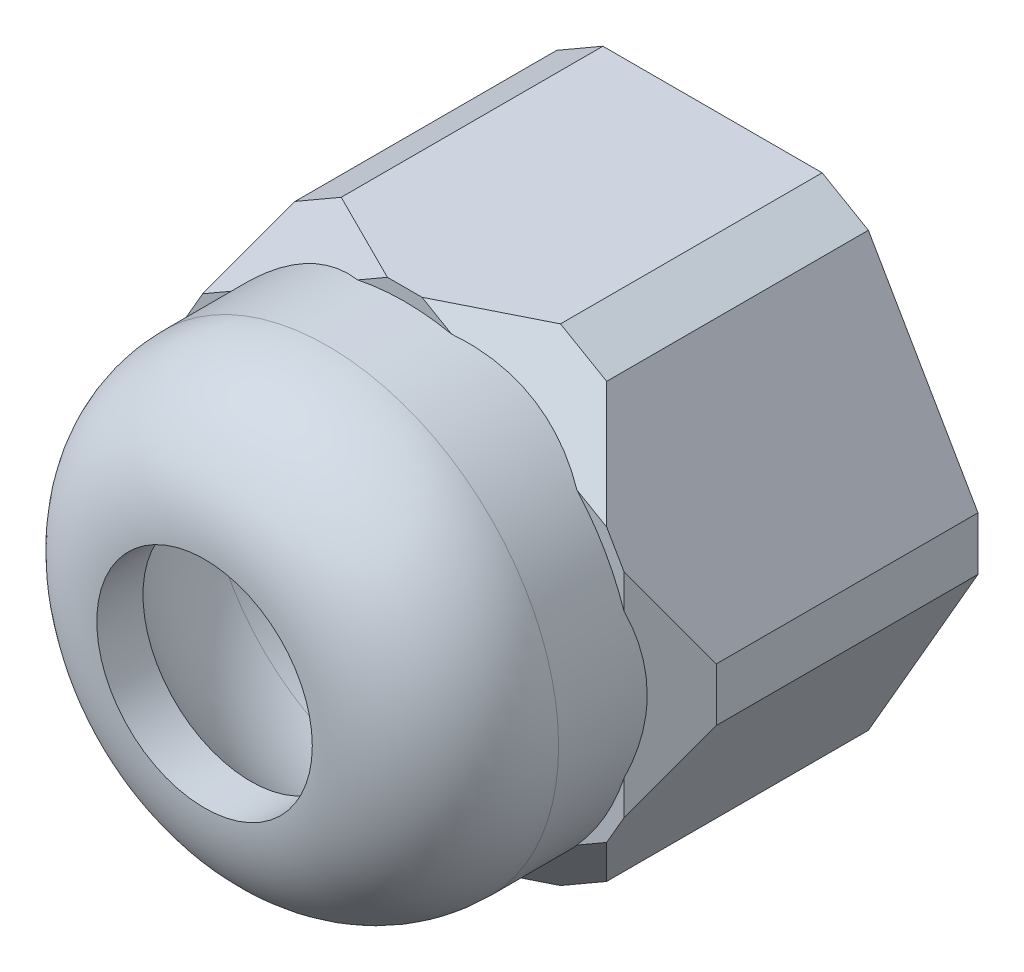
ISO-10303-21;
HEADER;
FILE_DESCRIPTION(('STEP AP214'),'2;1');
FILE_NAME('part.step','',(''),(''),'','','');
FILE_SCHEMA(('AUTOMOTIVE_DESIGN { 1 0 10303 214 1 1 1 1 }'));
ENDSEC;
DATA;
#1=APPLICATION_CONTEXT('core data for automotive mechanical design processes');
#2=APPLICATION_PROTOCOL_DEFINITION('international standard','automotive_design',2000,#1);
#3=PRODUCT_CONTEXT('',#1,'mechanical');
#4=PRODUCT('Part','Part','',(#3));
#5=PRODUCT_RELATED_PRODUCT_CATEGORY('part','',(#4));
#6=PRODUCT_DEFINITION_FORMATION('','',#4);
#7=PRODUCT_DEFINITION_CONTEXT('part definition',#1,'design');
#8=PRODUCT_DEFINITION('design','',#6,#7);
#9=PRODUCT_DEFINITION_SHAPE('','',#8);
#10=(LENGTH_UNIT() NAMED_UNIT(*) SI_UNIT(.MILLI.,.METRE.));
#11=(NAMED_UNIT(*) PLANE_ANGLE_UNIT() SI_UNIT($,.RADIAN.));
#12=(NAMED_UNIT(*) SI_UNIT($,.STERADIAN.) SOLID_ANGLE_UNIT());
#13=UNCERTAINTY_MEASURE_WITH_UNIT(LENGTH_MEASURE(1.E-05),#10,'distance_accuracy_value','');
#14=(GEOMETRIC_REPRESENTATION_CONTEXT(3) GLOBAL_UNCERTAINTY_ASSIGNED_CONTEXT((#13)) GLOBAL_UNIT_ASSIGNED_CONTEXT((#10,
#11,#12)) REPRESENTATION_CONTEXT('',''));
#15=CARTESIAN_POINT('',(0.,0.,0.));
#16=DIRECTION('',(0.,0.,1.));
#17=DIRECTION('',(1.,0.,0.));
#18=AXIS2_PLACEMENT_3D('',#15,#16,#17);
#19=CARTESIAN_POINT('',(0.,0.,10.));
#20=DIRECTION('',(0.,0.,1.));
#21=DIRECTION('',(1.,0.,0.));
#22=AXIS2_PLACEMENT_3D('',#19,#20,#21);
#23=PLANE('',#22);
#24=DIRECTION('',(-1.,0.,0.));
#25=VECTOR('',#24,1.);
#26=CARTESIAN_POINT('',(4.56106712659797,7.90000000000004,10.));
#27=LINE('',#26,#25);
#28=CARTESIAN_POINT('',(0.561067126597943,7.9,10.));
#29=VERTEX_POINT('',#28);
#30=CARTESIAN_POINT('',(-0.561067126598092,7.89999999999999,10.));
#31=VERTEX_POINT('',#30);
#32=EDGE_CURVE('E239',#29,#31,#27,.T.);
#33=ORIENTED_EDGE('',*,*,#32,.T.);
#34=DIRECTION('',(-0.866025403784435,-0.500000000000006,0.));
#35=VECTOR('',#34,1.);
#36=CARTESIAN_POINT('',(-3.56106712659808,6.16794919243109,10.));
#37=LINE('',#36,#35);
#38=CARTESIAN_POINT('',(-1.52540930673026,7.34323678270977,10.));
#39=VERTEX_POINT('',#38);
#40=EDGE_CURVE('E310',#31,#39,#37,.T.);
#41=ORIENTED_EDGE('',*,*,#40,.T.);
#42=CARTESIAN_POINT('',(0.,0.,10.));
#43=DIRECTION('',(0.,0.,1.));
#44=DIRECTION('',(1.,0.,0.));
#45=AXIS2_PLACEMENT_3D('',#42,#43,#44);
#46=CIRCLE('',#45,7.50000000000006);
#47=CARTESIAN_POINT('',(1.52540930673012,7.34323678270979,10.));
#48=VERTEX_POINT('',#47);
#49=EDGE_CURVE('E235',#48,#39,#46,.T.);
#50=ORIENTED_EDGE('',*,*,#49,.F.);
#51=DIRECTION('',(-0.866025403784444,0.499999999999991,0.));
#52=VECTOR('',#51,1.);
#53=CARTESIAN_POINT('',(3.56106712659797,6.16794919243115,10.));
#54=LINE('',#53,#52);
#55=EDGE_CURVE('E283',#48,#29,#54,.T.);
#56=ORIENTED_EDGE('',*,*,#55,.T.);
#57=EDGE_LOOP('',(#33,#41,#50,#56));
#58=FACE_BOUND('',#57,.T.);
#59=ADVANCED_FACE('F35',(#58),#23,.T.);
#60=CARTESIAN_POINT('',(-5.5967249464659,4.99266160215242,10.));
#61=VERTEX_POINT('',#60);
#62=CARTESIAN_POINT('',(-7.12213425319608,2.3505751805573,10.));
#63=VERTEX_POINT('',#62);
#64=EDGE_CURVE('E491',#61,#63,#46,.T.);
#65=ORIENTED_EDGE('',*,*,#64,.F.);
#66=DIRECTION('',(-0.866025403784435,-0.500000000000006,0.));
#67=VECTOR('',#66,1.);
#68=CARTESIAN_POINT('',(-3.56106712659808,6.16794919243109,10.));
#69=LINE('',#68,#67);
#70=CARTESIAN_POINT('',(-6.56106712659813,4.43589838486216,10.));
#71=VERTEX_POINT('',#70);
#72=EDGE_CURVE('E308',#61,#71,#69,.T.);
#73=ORIENTED_EDGE('',*,*,#72,.T.);
#74=DIRECTION('',(-0.499999999999995,-0.866025403784441,0.));
#75=VECTOR('',#74,1.);
#76=CARTESIAN_POINT('',(-4.56106712659814,7.89999999999995,10.));
#77=LINE('',#76,#75);
#78=CARTESIAN_POINT('',(-7.12213425319609,3.46410161513781,10.));
#79=VERTEX_POINT('',#78);
#80=EDGE_CURVE('E252',#71,#79,#77,.T.);
#81=ORIENTED_EDGE('',*,*,#80,.T.);
#82=DIRECTION('',(0.,-1.,0.));
#83=VECTOR('',#82,1.);
#84=CARTESIAN_POINT('',(-7.12213425319608,0.,10.));
#85=LINE('',#84,#83);
#86=EDGE_CURVE('E305',#79,#63,#85,.T.);
#87=ORIENTED_EDGE('',*,*,#86,.T.);
#88=EDGE_LOOP('',(#65,#73,#81,#87));
#89=FACE_BOUND('',#88,.T.);
#90=ADVANCED_FACE('F451',(#89),#23,.T.);
#91=CARTESIAN_POINT('',(-7.12213425319607,-2.35057518055735,10.));
#92=VERTEX_POINT('',#91);
#93=CARTESIAN_POINT('',(-5.59672494646587,-4.99266160215246,10.));
#94=VERTEX_POINT('',#93);
#95=EDGE_CURVE('E490',#92,#94,#46,.T.);
#96=ORIENTED_EDGE('',*,*,#95,.F.);
#97=DIRECTION('',(0.,-1.,0.));
#98=VECTOR('',#97,1.);
#99=CARTESIAN_POINT('',(-7.12213425319608,0.,10.));
#100=LINE('',#99,#98);
#101=CARTESIAN_POINT('',(-7.12213425319607,-3.46410161513778,10.));
#102=VERTEX_POINT('',#101);
#103=EDGE_CURVE('E303',#92,#102,#100,.T.);
#104=ORIENTED_EDGE('',*,*,#103,.T.);
#105=DIRECTION('',(0.500000000000001,-0.866025403784438,0.));
#106=VECTOR('',#105,1.);
#107=CARTESIAN_POINT('',(-9.12213425319609,0.,10.));
#108=LINE('',#107,#106);
#109=CARTESIAN_POINT('',(-6.56106712659804,-4.43589838486224,10.));
#110=VERTEX_POINT('',#109);
#111=EDGE_CURVE('E400',#102,#110,#108,.T.);
#112=ORIENTED_EDGE('',*,*,#111,.T.);
#113=DIRECTION('',(0.86602540378444,-0.499999999999998,0.));
#114=VECTOR('',#113,1.);
#115=CARTESIAN_POINT('',(-3.56106712659802,-6.16794919243112,10.));
#116=LINE('',#115,#114);
#117=EDGE_CURVE('E300',#110,#94,#116,.T.);
#118=ORIENTED_EDGE('',*,*,#117,.T.);
#119=EDGE_LOOP('',(#96,#104,#112,#118));
#120=FACE_BOUND('',#119,.T.);
#121=ADVANCED_FACE('F456',(#120),#23,.T.);
#122=CARTESIAN_POINT('',(-1.52540930673018,-7.34323678270978,10.));
#123=VERTEX_POINT('',#122);
#124=CARTESIAN_POINT('',(1.52540930673022,-7.34323678270978,10.));
#125=VERTEX_POINT('',#124);
#126=EDGE_CURVE('E473',#123,#125,#46,.T.);
#127=ORIENTED_EDGE('',*,*,#126,.F.);
#128=DIRECTION('',(0.86602540378444,-0.499999999999998,0.));
#129=VECTOR('',#128,1.);
#130=CARTESIAN_POINT('',(-3.56106712659802,-6.16794919243112,10.));
#131=LINE('',#130,#129);
#132=CARTESIAN_POINT('',(-0.561067126598001,-7.9,10.));
#133=VERTEX_POINT('',#132);
#134=EDGE_CURVE('E298',#123,#133,#131,.T.);
#135=ORIENTED_EDGE('',*,*,#134,.T.);
#136=DIRECTION('',(1.,0.,0.));
#137=VECTOR('',#136,1.);
#138=CARTESIAN_POINT('',(-4.56106712659803,-7.90000000000001,10.));
#139=LINE('',#138,#137);
#140=CARTESIAN_POINT('',(0.561067126598055,-7.89999999999999,10.));
#141=VERTEX_POINT('',#140);
#142=EDGE_CURVE('E395',#133,#141,#139,.T.);
#143=ORIENTED_EDGE('',*,*,#142,.T.);
#144=DIRECTION('',(0.866025403784436,0.500000000000004,0.));
#145=VECTOR('',#144,1.);
#146=CARTESIAN_POINT('',(3.56106712659807,-6.16794919243109,10.));
#147=LINE('',#146,#145);
#148=EDGE_CURVE('E295',#141,#125,#147,.T.);
#149=ORIENTED_EDGE('',*,*,#148,.T.);
#150=EDGE_LOOP('',(#127,#135,#143,#149));
#151=FACE_BOUND('',#150,.T.);
#152=ADVANCED_FACE('F466',(#151),#23,.T.);
#153=CARTESIAN_POINT('',(5.59672494646591,-4.99266160215241,10.));
#154=VERTEX_POINT('',#153);
#155=CARTESIAN_POINT('',(7.12213425319609,-2.35057518055729,10.));
#156=VERTEX_POINT('',#155);
#157=EDGE_CURVE('E237',#154,#156,#46,.T.);
#158=ORIENTED_EDGE('',*,*,#157,.F.);
#159=DIRECTION('',(0.866025403784436,0.500000000000004,0.));
#160=VECTOR('',#159,1.);
#161=CARTESIAN_POINT('',(3.56106712659807,-6.16794919243109,10.));
#162=LINE('',#161,#160);
#163=CARTESIAN_POINT('',(6.56106712659807,-4.43589838486219,10.));
#164=VERTEX_POINT('',#163);
#165=EDGE_CURVE('E293',#154,#164,#162,.T.);
#166=ORIENTED_EDGE('',*,*,#165,.T.);
#167=DIRECTION('',(0.499999999999995,0.866025403784442,0.));
#168=VECTOR('',#167,1.);
#169=CARTESIAN_POINT('',(4.56106712659808,-7.89999999999998,10.));
#170=LINE('',#169,#168);
#171=CARTESIAN_POINT('',(7.12213425319609,-3.46410161513773,10.));
#172=VERTEX_POINT('',#171);
#173=EDGE_CURVE('E394',#164,#172,#170,.T.);
#174=ORIENTED_EDGE('',*,*,#173,.T.);
#175=DIRECTION('',(0.,1.,0.));
#176=VECTOR('',#175,1.);
#177=CARTESIAN_POINT('',(7.12213425319607,0.,10.));
#178=LINE('',#177,#176);
#179=EDGE_CURVE('E290',#172,#156,#178,.T.);
#180=ORIENTED_EDGE('',*,*,#179,.T.);
#181=EDGE_LOOP('',(#158,#166,#174,#180));
#182=FACE_BOUND('',#181,.T.);
#183=ADVANCED_FACE('F459',(#182),#23,.T.);
#184=CARTESIAN_POINT('',(7.12213425319606,2.35057518055738,10.));
#185=VERTEX_POINT('',#184);
#186=CARTESIAN_POINT('',(5.59672494646583,4.9926616021525,10.));
#187=VERTEX_POINT('',#186);
#188=EDGE_CURVE('E229',#185,#187,#46,.T.);
#189=ORIENTED_EDGE('',*,*,#188,.F.);
#190=DIRECTION('',(0.,1.,0.));
#191=VECTOR('',#190,1.);
#192=CARTESIAN_POINT('',(7.12213425319607,0.,10.));
#193=LINE('',#192,#191);
#194=CARTESIAN_POINT('',(7.12213425319605,3.46410161513782,10.));
#195=VERTEX_POINT('',#194);
#196=EDGE_CURVE('E288',#185,#195,#193,.T.);
#197=ORIENTED_EDGE('',*,*,#196,.T.);
#198=DIRECTION('',(-0.500000000000007,0.866025403784435,0.));
#199=VECTOR('',#198,1.);
#200=CARTESIAN_POINT('',(9.12213425319609,0.,10.));
#201=LINE('',#200,#199);
#202=CARTESIAN_POINT('',(6.561067126598,4.43589838486229,10.));
#203=VERTEX_POINT('',#202);
#204=EDGE_CURVE('E393',#195,#203,#201,.T.);
#205=ORIENTED_EDGE('',*,*,#204,.T.);
#206=DIRECTION('',(-0.866025403784444,0.499999999999991,0.));
#207=VECTOR('',#206,1.);
#208=CARTESIAN_POINT('',(3.56106712659797,6.16794919243115,10.));
#209=LINE('',#208,#207);
#210=EDGE_CURVE('E285',#203,#187,#209,.T.);
#211=ORIENTED_EDGE('',*,*,#210,.T.);
#212=EDGE_LOOP('',(#189,#197,#205,#211));
#213=FACE_BOUND('',#212,.T.);
#214=ADVANCED_FACE('F362',(#213),#23,.T.);
#215=CARTESIAN_POINT('',(-4.56106712659814,7.89999999999995,10.));
#216=DIRECTION('',(0.866025403784442,-0.499999999999995,0.));
#217=DIRECTION('',(0.499999999999995,0.866025403784442,0.));
#218=AXIS2_PLACEMENT_3D('',#215,#216,#217);
#219=PLANE('',#218);
#220=ORIENTED_EDGE('',*,*,#80,.F.);
#221=DIRECTION('',(0.447213595499954,0.774596669241486,-0.447213595499958));
#222=VECTOR('',#221,1.);
#223=CARTESIAN_POINT('',(-5.36106712659812,6.51435935394486,8.79999999999998));
#224=LINE('',#223,#222);
#225=CARTESIAN_POINT('',(-5.06106712659813,7.03397459621551,8.49999999999999));
#226=VERTEX_POINT('',#225);
#227=EDGE_CURVE('E208',#71,#226,#224,.T.);
#228=ORIENTED_EDGE('',*,*,#227,.T.);
#229=DIRECTION('',(0.,0.,-1.));
#230=VECTOR('',#229,1.);
#231=CARTESIAN_POINT('',(-5.06106712659813,7.03397459621551,10.));
#232=LINE('',#231,#230);
#233=CARTESIAN_POINT('',(-5.06106712659813,7.03397459621551,0.));
#234=VERTEX_POINT('',#233);
#235=EDGE_CURVE('E199',#226,#234,#232,.T.);
#236=ORIENTED_EDGE('',*,*,#235,.T.);
#237=DIRECTION('',(-0.499999999999995,-0.866025403784441,0.));
#238=VECTOR('',#237,1.);
#239=CARTESIAN_POINT('',(-4.56106712659814,7.89999999999995,0.));
#240=LINE('',#239,#238);
#241=CARTESIAN_POINT('',(-8.62213425319609,0.86602540378445,0.));
#242=VERTEX_POINT('',#241);
#243=EDGE_CURVE('E205',#234,#242,#240,.T.);
#244=ORIENTED_EDGE('',*,*,#243,.T.);
#245=DIRECTION('',(0.,0.,1.));
#246=VECTOR('',#245,1.);
#247=CARTESIAN_POINT('',(-8.62213425319609,0.866025403784449,10.));
#248=LINE('',#247,#246);
#249=CARTESIAN_POINT('',(-8.62213425319609,0.866025403784449,8.49999999999999));
#250=VERTEX_POINT('',#249);
#251=EDGE_CURVE('E212',#242,#250,#248,.T.);
#252=ORIENTED_EDGE('',*,*,#251,.T.);
#253=DIRECTION('',(0.447213595499954,0.774596669241487,0.447213595499956));
#254=VECTOR('',#253,1.);
#255=CARTESIAN_POINT('',(-8.3221342531961,1.38564064605509,8.79999999999998));
#256=LINE('',#255,#254);
#257=EDGE_CURVE('E313',#250,#79,#256,.T.);
#258=ORIENTED_EDGE('',*,*,#257,.T.);
#259=EDGE_LOOP('',(#220,#228,#236,#244,#252,#258));
#260=FACE_BOUND('',#259,.T.);
#261=ADVANCED_FACE('F202',(#260),#219,.F.);
#262=CARTESIAN_POINT('',(-9.12213425319609,0.,10.));
#263=DIRECTION('',(0.866025403784438,0.500000000000001,0.));
#264=DIRECTION('',(-0.500000000000001,0.866025403784438,0.));
#265=AXIS2_PLACEMENT_3D('',#262,#263,#264);
#266=PLANE('',#265);
#267=ORIENTED_EDGE('',*,*,#111,.F.);
#268=DIRECTION('',(-0.447213595499959,0.774596669241484,-0.447213595499957));
#269=VECTOR('',#268,1.);
#270=CARTESIAN_POINT('',(-8.32213425319608,-1.38564064605512,8.8));
#271=LINE('',#270,#269);
#272=CARTESIAN_POINT('',(-8.62213425319609,-0.866025403784444,8.49999999999999));
#273=VERTEX_POINT('',#272);
#274=EDGE_CURVE('E324',#102,#273,#271,.T.);
#275=ORIENTED_EDGE('',*,*,#274,.T.);
#276=DIRECTION('',(0.,0.,-1.));
#277=VECTOR('',#276,1.);
#278=CARTESIAN_POINT('',(-8.62213425319609,-0.866025403784444,10.));
#279=LINE('',#278,#277);
#280=CARTESIAN_POINT('',(-8.62213425319609,-0.866025403784443,0.));
#281=VERTEX_POINT('',#280);
#282=EDGE_CURVE('E267',#273,#281,#279,.T.);
#283=ORIENTED_EDGE('',*,*,#282,.T.);
#284=DIRECTION('',(0.500000000000001,-0.866025403784438,0.));
#285=VECTOR('',#284,1.);
#286=CARTESIAN_POINT('',(-9.12213425319609,0.,0.));
#287=LINE('',#286,#285);
#288=CARTESIAN_POINT('',(-5.06106712659803,-7.03397459621557,0.));
#289=VERTEX_POINT('',#288);
#290=EDGE_CURVE('E228',#281,#289,#287,.T.);
#291=ORIENTED_EDGE('',*,*,#290,.T.);
#292=DIRECTION('',(0.,0.,1.));
#293=VECTOR('',#292,1.);
#294=CARTESIAN_POINT('',(-5.06106712659803,-7.03397459621557,10.));
#295=LINE('',#294,#293);
#296=CARTESIAN_POINT('',(-5.06106712659803,-7.03397459621557,8.49999999999999));
#297=VERTEX_POINT('',#296);
#298=EDGE_CURVE('E264',#289,#297,#295,.T.);
#299=ORIENTED_EDGE('',*,*,#298,.T.);
#300=DIRECTION('',(-0.447213595499959,0.774596669241483,0.447213595499958));
#301=VECTOR('',#300,1.);
#302=CARTESIAN_POINT('',(-5.36106712659803,-6.5143593539449,8.79999999999999));
#303=LINE('',#302,#301);
#304=EDGE_CURVE('E322',#297,#110,#303,.T.);
#305=ORIENTED_EDGE('',*,*,#304,.T.);
#306=EDGE_LOOP('',(#267,#275,#283,#291,#299,#305));
#307=FACE_BOUND('',#306,.T.);
#308=ADVANCED_FACE('F464',(#307),#266,.F.);
#309=CARTESIAN_POINT('',(-4.56106712659803,-7.90000000000001,10.));
#310=DIRECTION('',(0.,1.,0.));
#311=DIRECTION('',(-1.,0.,0.));
#312=AXIS2_PLACEMENT_3D('',#309,#310,#311);
#313=PLANE('',#312);
#314=ORIENTED_EDGE('',*,*,#142,.F.);
#315=DIRECTION('',(-0.894427190999916,0.,-0.447213595499958));
#316=VECTOR('',#315,1.);
#317=CARTESIAN_POINT('',(-2.96106712659801,-7.90000000000001,8.8));
#318=LINE('',#317,#316);
#319=CARTESIAN_POINT('',(-3.56106712659802,-7.90000000000001,8.49999999999999));
#320=VERTEX_POINT('',#319);
#321=EDGE_CURVE('E330',#133,#320,#318,.T.);
#322=ORIENTED_EDGE('',*,*,#321,.T.);
#323=DIRECTION('',(0.,0.,-1.));
#324=VECTOR('',#323,1.);
#325=CARTESIAN_POINT('',(-3.56106712659802,-7.90000000000001,10.));
#326=LINE('',#325,#324);
#327=CARTESIAN_POINT('',(-3.56106712659802,-7.90000000000001,0.));
#328=VERTEX_POINT('',#327);
#329=EDGE_CURVE('E272',#320,#328,#326,.T.);
#330=ORIENTED_EDGE('',*,*,#329,.T.);
#331=DIRECTION('',(1.,0.,0.));
#332=VECTOR('',#331,1.);
#333=CARTESIAN_POINT('',(-4.56106712659803,-7.90000000000001,0.));
#334=LINE('',#333,#332);
#335=CARTESIAN_POINT('',(3.56106712659807,-7.89999999999998,0.));
#336=VERTEX_POINT('',#335);
#337=EDGE_CURVE('E232',#328,#336,#334,.T.);
#338=ORIENTED_EDGE('',*,*,#337,.T.);
#339=DIRECTION('',(0.,0.,1.));
#340=VECTOR('',#339,1.);
#341=CARTESIAN_POINT('',(3.56106712659807,-7.89999999999998,10.));
#342=LINE('',#341,#340);
#343=CARTESIAN_POINT('',(3.56106712659807,-7.89999999999998,8.49999999999999));
#344=VERTEX_POINT('',#343);
#345=EDGE_CURVE('E269',#336,#344,#342,.T.);
#346=ORIENTED_EDGE('',*,*,#345,.T.);
#347=DIRECTION('',(-0.894427190999916,0.,0.447213595499958));
#348=VECTOR('',#347,1.);
#349=CARTESIAN_POINT('',(2.96106712659807,-7.89999999999999,8.79999999999999));
#350=LINE('',#349,#348);
#351=EDGE_CURVE('E328',#344,#141,#350,.T.);
#352=ORIENTED_EDGE('',*,*,#351,.T.);
#353=EDGE_LOOP('',(#314,#322,#330,#338,#346,#352));
#354=FACE_BOUND('',#353,.T.);
#355=ADVANCED_FACE('F485',(#354),#313,.F.);
#356=CARTESIAN_POINT('',(4.56106712659808,-7.89999999999998,10.));
#357=DIRECTION('',(-0.866025403784442,0.499999999999995,0.));
#358=DIRECTION('',(-0.499999999999995,-0.866025403784442,0.));
#359=AXIS2_PLACEMENT_3D('',#356,#357,#358);
#360=PLANE('',#359);
#361=ORIENTED_EDGE('',*,*,#173,.F.);
#362=DIRECTION('',(-0.447213595499953,-0.774596669241486,-0.447213595499958));
#363=VECTOR('',#362,1.);
#364=CARTESIAN_POINT('',(5.36106712659808,-6.51435935394486,8.79999999999999));
#365=LINE('',#364,#363);
#366=CARTESIAN_POINT('',(5.06106712659808,-7.03397459621553,8.49999999999999));
#367=VERTEX_POINT('',#366);
#368=EDGE_CURVE('E336',#164,#367,#365,.T.);
#369=ORIENTED_EDGE('',*,*,#368,.T.);
#370=DIRECTION('',(0.,0.,-1.));
#371=VECTOR('',#370,1.);
#372=CARTESIAN_POINT('',(5.06106712659808,-7.03397459621553,10.));
#373=LINE('',#372,#371);
#374=CARTESIAN_POINT('',(5.06106712659808,-7.03397459621553,0.));
#375=VERTEX_POINT('',#374);
#376=EDGE_CURVE('E277',#367,#375,#373,.T.);
#377=ORIENTED_EDGE('',*,*,#376,.T.);
#378=DIRECTION('',(0.499999999999995,0.866025403784442,0.));
#379=VECTOR('',#378,1.);
#380=CARTESIAN_POINT('',(4.56106712659808,-7.89999999999998,0.));
#381=LINE('',#380,#379);
#382=CARTESIAN_POINT('',(8.62213425319609,-0.866025403784384,0.));
#383=VERTEX_POINT('',#382);
#384=EDGE_CURVE('E244',#375,#383,#381,.T.);
#385=ORIENTED_EDGE('',*,*,#384,.T.);
#386=DIRECTION('',(0.,0.,1.));
#387=VECTOR('',#386,1.);
#388=CARTESIAN_POINT('',(8.62213425319609,-0.866025403784384,10.));
#389=LINE('',#388,#387);
#390=CARTESIAN_POINT('',(8.62213425319609,-0.866025403784384,8.49999999999999));
#391=VERTEX_POINT('',#390);
#392=EDGE_CURVE('E274',#383,#391,#389,.T.);
#393=ORIENTED_EDGE('',*,*,#392,.T.);
#394=DIRECTION('',(-0.447213595499953,-0.774596669241486,0.447213595499958));
#395=VECTOR('',#394,1.);
#396=CARTESIAN_POINT('',(8.32213425319609,-1.38564064605506,8.8));
#397=LINE('',#396,#395);
#398=EDGE_CURVE('E334',#391,#172,#397,.T.);
#399=ORIENTED_EDGE('',*,*,#398,.T.);
#400=EDGE_LOOP('',(#361,#369,#377,#385,#393,#399));
#401=FACE_BOUND('',#400,.T.);
#402=ADVANCED_FACE('F374',(#401),#360,.F.);
#403=CARTESIAN_POINT('',(9.12213425319609,0.,10.));
#404=DIRECTION('',(-0.866025403784435,-0.500000000000007,0.));
#405=DIRECTION('',(0.500000000000007,-0.866025403784435,0.));
#406=AXIS2_PLACEMENT_3D('',#403,#404,#405);
#407=PLANE('',#406);
#408=ORIENTED_EDGE('',*,*,#204,.F.);
#409=DIRECTION('',(0.447213595499964,-0.774596669241479,-0.447213595499959));
#410=VECTOR('',#409,1.);
#411=CARTESIAN_POINT('',(8.32213425319607,1.38564064605517,8.79999999999999));
#412=LINE('',#411,#410);
#413=CARTESIAN_POINT('',(8.62213425319608,0.866025403784502,8.49999999999999));
#414=VERTEX_POINT('',#413);
#415=EDGE_CURVE('E59',#195,#414,#412,.T.);
#416=ORIENTED_EDGE('',*,*,#415,.T.);
#417=DIRECTION('',(0.,0.,-1.));
#418=VECTOR('',#417,1.);
#419=CARTESIAN_POINT('',(8.62213425319608,0.866025403784502,10.));
#420=LINE('',#419,#418);
#421=CARTESIAN_POINT('',(8.62213425319608,0.866025403784502,0.));
#422=VERTEX_POINT('',#421);
#423=EDGE_CURVE('E281',#414,#422,#420,.T.);
#424=ORIENTED_EDGE('',*,*,#423,.T.);
#425=DIRECTION('',(-0.500000000000007,0.866025403784435,0.));
#426=VECTOR('',#425,1.);
#427=CARTESIAN_POINT('',(9.12213425319609,0.,0.));
#428=LINE('',#427,#426);
#429=CARTESIAN_POINT('',(5.06106712659798,7.03397459621561,0.));
#430=VERTEX_POINT('',#429);
#431=EDGE_CURVE('E247',#422,#430,#428,.T.);
#432=ORIENTED_EDGE('',*,*,#431,.T.);
#433=DIRECTION('',(0.,0.,1.));
#434=VECTOR('',#433,1.);
#435=CARTESIAN_POINT('',(5.06106712659798,7.0339745962156,10.));
#436=LINE('',#435,#434);
#437=CARTESIAN_POINT('',(5.06106712659798,7.0339745962156,8.49999999999999));
#438=VERTEX_POINT('',#437);
#439=EDGE_CURVE('E279',#430,#438,#436,.T.);
#440=ORIENTED_EDGE('',*,*,#439,.T.);
#441=DIRECTION('',(0.447213595499964,-0.774596669241479,0.447213595499959));
#442=VECTOR('',#441,1.);
#443=CARTESIAN_POINT('',(5.36106712659799,6.51435935394494,8.79999999999999));
#444=LINE('',#443,#442);
#445=EDGE_CURVE('E340',#438,#203,#444,.T.);
#446=ORIENTED_EDGE('',*,*,#445,.T.);
#447=EDGE_LOOP('',(#408,#416,#424,#432,#440,#446));
#448=FACE_BOUND('',#447,.T.);
#449=ADVANCED_FACE('F382',(#448),#407,.F.);
#450=CARTESIAN_POINT('',(4.56106712659797,7.90000000000004,10.));
#451=DIRECTION('',(0.,-1.,0.));
#452=DIRECTION('',(1.,0.,0.));
#453=AXIS2_PLACEMENT_3D('',#450,#451,#452);
#454=PLANE('',#453);
#455=DIRECTION('',(0.,0.,1.));
#456=VECTOR('',#455,1.);
#457=CARTESIAN_POINT('',(-3.56106712659813,7.89999999999996,10.));
#458=LINE('',#457,#456);
#459=CARTESIAN_POINT('',(-3.56106712659813,7.89999999999996,0.));
#460=VERTEX_POINT('',#459);
#461=CARTESIAN_POINT('',(-3.56106712659813,7.89999999999996,8.49999999999999));
#462=VERTEX_POINT('',#461);
#463=EDGE_CURVE('E218',#460,#462,#458,.T.);
#464=ORIENTED_EDGE('',*,*,#463,.T.);
#465=DIRECTION('',(0.894427190999917,0.,0.447213595499956));
#466=VECTOR('',#465,1.);
#467=CARTESIAN_POINT('',(-2.9610671265981,7.89999999999997,8.8));
#468=LINE('',#467,#466);
#469=EDGE_CURVE('E320',#462,#31,#468,.T.);
#470=ORIENTED_EDGE('',*,*,#469,.T.);
#471=ORIENTED_EDGE('',*,*,#32,.F.);
#472=DIRECTION('',(0.894427190999916,0.,-0.447213595499958));
#473=VECTOR('',#472,1.);
#474=CARTESIAN_POINT('',(2.96106712659795,7.90000000000003,8.8));
#475=LINE('',#474,#473);
#476=CARTESIAN_POINT('',(3.56106712659796,7.90000000000003,8.49999999999999));
#477=VERTEX_POINT('',#476);
#478=EDGE_CURVE('E318',#29,#477,#475,.T.);
#479=ORIENTED_EDGE('',*,*,#478,.T.);
#480=DIRECTION('',(0.,0.,-1.));
#481=VECTOR('',#480,1.);
#482=CARTESIAN_POINT('',(3.56106712659796,7.90000000000003,10.));
#483=LINE('',#482,#481);
#484=CARTESIAN_POINT('',(3.56106712659796,7.90000000000003,0.));
#485=VERTEX_POINT('',#484);
#486=EDGE_CURVE('E222',#477,#485,#483,.T.);
#487=ORIENTED_EDGE('',*,*,#486,.T.);
#488=DIRECTION('',(-1.,0.,0.));
#489=VECTOR('',#488,1.);
#490=CARTESIAN_POINT('',(4.56106712659797,7.90000000000004,0.));
#491=LINE('',#490,#489);
#492=EDGE_CURVE('E250',#485,#460,#491,.T.);
#493=ORIENTED_EDGE('',*,*,#492,.T.);
#494=EDGE_LOOP('',(#464,#470,#471,#479,#487,#493));
#495=FACE_BOUND('',#494,.T.);
#496=ADVANCED_FACE('F386',(#495),#454,.F.);
#497=CARTESIAN_POINT('',(0.,0.,0.));
#498=DIRECTION('',(0.,0.,1.));
#499=DIRECTION('',(1.,0.,0.));
#500=AXIS2_PLACEMENT_3D('',#497,#498,#499);
#501=PLANE('',#500);
#502=CARTESIAN_POINT('',(0.,0.,0.));
#503=DIRECTION('',(0.,0.,1.));
#504=DIRECTION('',(1.,0.,0.));
#505=AXIS2_PLACEMENT_3D('',#502,#503,#504);
#506=CIRCLE('',#505,6.50000000000006);
#507=CARTESIAN_POINT('',(6.50000000000006,0.,0.));
#508=VERTEX_POINT('',#507);
#509=EDGE_CURVE('E414',#508,#508,#506,.F.);
#510=ORIENTED_EDGE('',*,*,#509,.F.);
#511=EDGE_LOOP('',(#510));
#512=FACE_BOUND('',#511,.T.);
#513=ORIENTED_EDGE('',*,*,#243,.F.);
#514=DIRECTION('',(-0.866025403784435,-0.500000000000006,0.));
#515=VECTOR('',#514,1.);
#516=CARTESIAN_POINT('',(-5.06106712659813,7.03397459621551,0.));
#517=LINE('',#516,#515);
#518=EDGE_CURVE('E215',#234,#460,#517,.F.);
#519=ORIENTED_EDGE('',*,*,#518,.T.);
#520=ORIENTED_EDGE('',*,*,#492,.F.);
#521=DIRECTION('',(-0.866025403784444,0.499999999999991,0.));
#522=VECTOR('',#521,1.);
#523=CARTESIAN_POINT('',(3.56106712659796,7.90000000000003,0.));
#524=LINE('',#523,#522);
#525=EDGE_CURVE('E211',#485,#430,#524,.F.);
#526=ORIENTED_EDGE('',*,*,#525,.T.);
#527=ORIENTED_EDGE('',*,*,#431,.F.);
#528=DIRECTION('',(0.,1.,0.));
#529=VECTOR('',#528,1.);
#530=CARTESIAN_POINT('',(8.62213425319608,0.866025403784501,0.));
#531=LINE('',#530,#529);
#532=EDGE_CURVE('E255',#422,#383,#531,.F.);
#533=ORIENTED_EDGE('',*,*,#532,.T.);
#534=ORIENTED_EDGE('',*,*,#384,.F.);
#535=DIRECTION('',(0.866025403784436,0.500000000000004,0.));
#536=VECTOR('',#535,1.);
#537=CARTESIAN_POINT('',(5.06106712659808,-7.03397459621553,0.));
#538=LINE('',#537,#536);
#539=EDGE_CURVE('E257',#375,#336,#538,.F.);
#540=ORIENTED_EDGE('',*,*,#539,.T.);
#541=ORIENTED_EDGE('',*,*,#337,.F.);
#542=DIRECTION('',(0.86602540378444,-0.499999999999998,0.));
#543=VECTOR('',#542,1.);
#544=CARTESIAN_POINT('',(-3.56106712659802,-7.90000000000001,0.));
#545=LINE('',#544,#543);
#546=EDGE_CURVE('E259',#328,#289,#545,.F.);
#547=ORIENTED_EDGE('',*,*,#546,.T.);
#548=ORIENTED_EDGE('',*,*,#290,.F.);
#549=DIRECTION('',(0.,-1.,0.));
#550=VECTOR('',#549,1.);
#551=CARTESIAN_POINT('',(-8.62213425319609,-0.866025403784442,0.));
#552=LINE('',#551,#550);
#553=EDGE_CURVE('E223',#281,#242,#552,.F.);
#554=ORIENTED_EDGE('',*,*,#553,.T.);
#555=EDGE_LOOP('',(#513,#519,#520,#526,#527,#533,#534,#540,#541,#547,#548,#554));
#556=FACE_BOUND('',#555,.T.);
#557=ADVANCED_FACE('F225',(#512,#556),#501,.F.);
#558=CARTESIAN_POINT('',(0.,0.,20.3861431548372));
#559=DIRECTION('',(0.,0.,1.));
#560=DIRECTION('',(1.,0.,0.));
#561=AXIS2_PLACEMENT_3D('',#558,#559,#560);
#562=CYLINDRICAL_SURFACE('',#561,7.50000000000006);
#563=CARTESIAN_POINT('',(0.,0.,12.5));
#564=DIRECTION('',(0.,0.,1.));
#565=DIRECTION('',(1.,0.,0.));
#566=AXIS2_PLACEMENT_3D('',#563,#564,#565);
#567=CIRCLE('',#566,7.50000000000006);
#568=CARTESIAN_POINT('',(7.50000000000006,0.,12.5));
#569=VERTEX_POINT('',#568);
#570=EDGE_CURVE('E405',#569,#569,#567,.T.);
#571=ORIENTED_EDGE('',*,*,#570,.F.);
#572=EDGE_LOOP('',(#571));
#573=FACE_BOUND('',#572,.T.);
#574=ORIENTED_EDGE('',*,*,#188,.T.);
#575=CARTESIAN_POINT('',(0.,0.,17.1221342531961));
#576=DIRECTION('',(0.353553390593267,0.612372435695798,0.707106781186548));
#577=DIRECTION('',(-0.353553390593268,-0.612372435695798,0.707106781186547));
#578=AXIS2_PLACEMENT_3D('',#575,#576,#577);
#579=ELLIPSE('',#578,10.6066017177983,7.50000000000006);
#580=EDGE_CURVE('E11',#187,#48,#579,.T.);
#581=ORIENTED_EDGE('',*,*,#580,.T.);
#582=ORIENTED_EDGE('',*,*,#49,.T.);
#583=CARTESIAN_POINT('',(0.,0.,17.1221342531961));
#584=DIRECTION('',(-0.353553390593278,0.612372435695792,0.707106781186547));
#585=DIRECTION('',(0.353553390593278,-0.612372435695792,0.707106781186548));
#586=AXIS2_PLACEMENT_3D('',#583,#584,#585);
#587=ELLIPSE('',#586,10.6066017177983,7.50000000000006);
#588=EDGE_CURVE('E346',#39,#61,#587,.T.);
#589=ORIENTED_EDGE('',*,*,#588,.T.);
#590=ORIENTED_EDGE('',*,*,#64,.T.);
#591=CARTESIAN_POINT('',(0.,0.,17.1221342531961));
#592=DIRECTION('',(-0.707106781186547,0.,0.707106781186548));
#593=DIRECTION('',(0.707106781186548,0.,0.707106781186547));
#594=AXIS2_PLACEMENT_3D('',#591,#592,#593);
#595=ELLIPSE('',#594,10.6066017177983,7.50000000000006);
#596=EDGE_CURVE('E348',#63,#92,#595,.T.);
#597=ORIENTED_EDGE('',*,*,#596,.T.);
#598=ORIENTED_EDGE('',*,*,#95,.T.);
#599=CARTESIAN_POINT('',(0.,0.,17.1221342531961));
#600=DIRECTION('',(-0.353553390593272,-0.612372435695795,0.707106781186548));
#601=DIRECTION('',(0.353553390593272,0.612372435695796,0.707106781186547));
#602=AXIS2_PLACEMENT_3D('',#599,#600,#601);
#603=ELLIPSE('',#602,10.6066017177983,7.50000000000006);
#604=EDGE_CURVE('E350',#94,#123,#603,.T.);
#605=ORIENTED_EDGE('',*,*,#604,.T.);
#606=ORIENTED_EDGE('',*,*,#126,.T.);
#607=CARTESIAN_POINT('',(0.,0.,17.1221342531961));
#608=DIRECTION('',(0.353553390593277,-0.612372435695792,0.707106781186548));
#609=DIRECTION('',(-0.353553390593277,0.612372435695793,0.707106781186547));
#610=AXIS2_PLACEMENT_3D('',#607,#608,#609);
#611=ELLIPSE('',#610,10.6066017177983,7.50000000000006);
#612=EDGE_CURVE('E352',#125,#154,#611,.T.);
#613=ORIENTED_EDGE('',*,*,#612,.T.);
#614=ORIENTED_EDGE('',*,*,#157,.T.);
#615=CARTESIAN_POINT('',(0.,0.,17.1221342531961));
#616=DIRECTION('',(0.707106781186547,0.,0.707106781186548));
#617=DIRECTION('',(-0.707106781186548,0.,0.707106781186547));
#618=AXIS2_PLACEMENT_3D('',#615,#616,#617);
#619=ELLIPSE('',#618,10.6066017177983,7.50000000000006);
#620=EDGE_CURVE('E44',#156,#185,#619,.T.);
#621=ORIENTED_EDGE('',*,*,#620,.T.);
#622=EDGE_LOOP('',(#574,#581,#582,#589,#590,#597,#598,#605,#606,#613,#614,#621));
#623=FACE_BOUND('',#622,.T.);
#624=ADVANCED_FACE('F356',(#573,#623),#562,.T.);
#625=CARTESIAN_POINT('',(0.,0.,12.5));
#626=DIRECTION('',(0.,0.,1.));
#627=DIRECTION('',(1.,0.,0.));
#628=AXIS2_PLACEMENT_3D('',#625,#626,#627);
#629=DEGENERATE_TOROIDAL_SURFACE('',#628,3.5,4.00000000000006,.T.);
#630=CARTESIAN_POINT('',(0.,0.,16.5000000000001));
#631=DIRECTION('',(0.,0.,1.));
#632=DIRECTION('',(1.,0.,0.));
#633=AXIS2_PLACEMENT_3D('',#630,#631,#632);
#634=CIRCLE('',#633,3.5);
#635=CARTESIAN_POINT('',(3.5,0.,16.5000000000001));
#636=VERTEX_POINT('',#635);
#637=EDGE_CURVE('E408',#636,#636,#634,.T.);
#638=ORIENTED_EDGE('',*,*,#637,.F.);
#639=EDGE_LOOP('',(#638));
#640=FACE_BOUND('',#639,.T.);
#641=ORIENTED_EDGE('',*,*,#570,.T.);
#642=EDGE_LOOP('',(#641));
#643=FACE_BOUND('',#642,.T.);
#644=ADVANCED_FACE('F433',(#640,#643),#629,.T.);
#645=CARTESIAN_POINT('',(0.,0.,20.3861431548372));
#646=DIRECTION('',(0.,0.,1.));
#647=DIRECTION('',(1.,0.,0.));
#648=AXIS2_PLACEMENT_3D('',#645,#646,#647);
#649=CYLINDRICAL_SURFACE('',#648,3.5);
#650=CARTESIAN_POINT('',(0.,0.,15.0000000000001));
#651=DIRECTION('',(0.,0.,1.));
#652=DIRECTION('',(1.,0.,0.));
#653=AXIS2_PLACEMENT_3D('',#650,#651,#652);
#654=CIRCLE('',#653,3.5);
#655=CARTESIAN_POINT('',(3.5,0.,15.0000000000001));
#656=VERTEX_POINT('',#655);
#657=EDGE_CURVE('E411',#656,#656,#654,.T.);
#658=ORIENTED_EDGE('',*,*,#657,.F.);
#659=EDGE_LOOP('',(#658));
#660=FACE_BOUND('',#659,.T.);
#661=ORIENTED_EDGE('',*,*,#637,.T.);
#662=EDGE_LOOP('',(#661));
#663=FACE_BOUND('',#662,.T.);
#664=ADVANCED_FACE('F427',(#660,#663),#649,.F.);
#665=CARTESIAN_POINT('',(0.,0.,10.));
#666=DIRECTION('',(0.,0.,1.));
#667=DIRECTION('',(1.,0.,0.));
#668=AXIS2_PLACEMENT_3D('',#665,#666,#667);
#669=DEGENERATE_TOROIDAL_SURFACE('',#668,0.83333333333335,5.66666666666671,.T.);
#670=CARTESIAN_POINT('',(0.,0.,10.));
#671=DIRECTION('',(0.,0.,1.));
#672=DIRECTION('',(1.,0.,0.));
#673=AXIS2_PLACEMENT_3D('',#670,#671,#672);
#674=CIRCLE('',#673,6.50000000000006);
#675=CARTESIAN_POINT('',(6.50000000000006,0.,10.));
#676=VERTEX_POINT('',#675);
#677=EDGE_CURVE('E417',#676,#676,#674,.T.);
#678=ORIENTED_EDGE('',*,*,#677,.F.);
#679=EDGE_LOOP('',(#678));
#680=FACE_BOUND('',#679,.T.);
#681=ORIENTED_EDGE('',*,*,#657,.T.);
#682=EDGE_LOOP('',(#681));
#683=FACE_BOUND('',#682,.T.);
#684=ADVANCED_FACE('F424',(#680,#683),#669,.F.);
#685=CARTESIAN_POINT('',(0.,0.,-0.000999999999999265));
#686=DIRECTION('',(0.,0.,1.));
#687=DIRECTION('',(1.,0.,0.));
#688=AXIS2_PLACEMENT_3D('',#685,#686,#687);
#689=CYLINDRICAL_SURFACE('',#688,6.50000000000006);
#690=ORIENTED_EDGE('',*,*,#677,.T.);
#691=EDGE_LOOP('',(#690));
#692=FACE_BOUND('',#691,.T.);
#693=ORIENTED_EDGE('',*,*,#509,.T.);
#694=EDGE_LOOP('',(#693));
#695=FACE_BOUND('',#694,.T.);
#696=ADVANCED_FACE('F421',(#692,#695),#689,.F.);
#697=CARTESIAN_POINT('',(-5.06106712659813,7.03397459621551,10.));
#698=DIRECTION('',(0.500000000000006,-0.866025403784435,0.));
#699=DIRECTION('',(0.,0.,-1.));
#700=AXIS2_PLACEMENT_3D('',#697,#698,#699);
#701=PLANE('',#700);
#702=ORIENTED_EDGE('',*,*,#235,.F.);
#703=DIRECTION('',(-0.866025403784435,-0.500000000000006,0.));
#704=VECTOR('',#703,1.);
#705=CARTESIAN_POINT('',(-5.06106712659813,7.03397459621551,8.49999999999999));
#706=LINE('',#705,#704);
#707=EDGE_CURVE('E316',#226,#462,#706,.F.);
#708=ORIENTED_EDGE('',*,*,#707,.T.);
#709=ORIENTED_EDGE('',*,*,#463,.F.);
#710=ORIENTED_EDGE('',*,*,#518,.F.);
#711=EDGE_LOOP('',(#702,#708,#709,#710));
#712=FACE_BOUND('',#711,.T.);
#713=ADVANCED_FACE('F216',(#712),#701,.F.);
#714=CARTESIAN_POINT('',(-8.62213425319609,-0.866025403784442,10.));
#715=DIRECTION('',(1.,0.,0.));
#716=DIRECTION('',(0.,0.,-1.));
#717=AXIS2_PLACEMENT_3D('',#714,#715,#716);
#718=PLANE('',#717);
#719=ORIENTED_EDGE('',*,*,#282,.F.);
#720=DIRECTION('',(0.,-1.,0.));
#721=VECTOR('',#720,1.);
#722=CARTESIAN_POINT('',(-8.62213425319609,-0.866025403784442,8.49999999999999));
#723=LINE('',#722,#721);
#724=EDGE_CURVE('E326',#273,#250,#723,.F.);
#725=ORIENTED_EDGE('',*,*,#724,.T.);
#726=ORIENTED_EDGE('',*,*,#251,.F.);
#727=ORIENTED_EDGE('',*,*,#553,.F.);
#728=EDGE_LOOP('',(#719,#725,#726,#727));
#729=FACE_BOUND('',#728,.T.);
#730=ADVANCED_FACE('F524',(#729),#718,.F.);
#731=CARTESIAN_POINT('',(-3.56106712659802,-7.90000000000001,10.));
#732=DIRECTION('',(0.499999999999998,0.86602540378444,0.));
#733=DIRECTION('',(0.,0.,-1.));
#734=AXIS2_PLACEMENT_3D('',#731,#732,#733);
#735=PLANE('',#734);
#736=ORIENTED_EDGE('',*,*,#329,.F.);
#737=DIRECTION('',(0.86602540378444,-0.499999999999998,0.));
#738=VECTOR('',#737,1.);
#739=CARTESIAN_POINT('',(-3.56106712659802,-7.90000000000001,8.49999999999999));
#740=LINE('',#739,#738);
#741=EDGE_CURVE('E332',#320,#297,#740,.F.);
#742=ORIENTED_EDGE('',*,*,#741,.T.);
#743=ORIENTED_EDGE('',*,*,#298,.F.);
#744=ORIENTED_EDGE('',*,*,#546,.F.);
#745=EDGE_LOOP('',(#736,#742,#743,#744));
#746=FACE_BOUND('',#745,.T.);
#747=ADVANCED_FACE('F519',(#746),#735,.F.);
#748=CARTESIAN_POINT('',(5.06106712659808,-7.03397459621553,10.));
#749=DIRECTION('',(-0.500000000000004,0.866025403784436,0.));
#750=DIRECTION('',(0.,0.,-1.));
#751=AXIS2_PLACEMENT_3D('',#748,#749,#750);
#752=PLANE('',#751);
#753=ORIENTED_EDGE('',*,*,#376,.F.);
#754=DIRECTION('',(0.866025403784436,0.500000000000004,0.));
#755=VECTOR('',#754,1.);
#756=CARTESIAN_POINT('',(5.06106712659808,-7.03397459621553,8.49999999999999));
#757=LINE('',#756,#755);
#758=EDGE_CURVE('E338',#367,#344,#757,.F.);
#759=ORIENTED_EDGE('',*,*,#758,.T.);
#760=ORIENTED_EDGE('',*,*,#345,.F.);
#761=ORIENTED_EDGE('',*,*,#539,.F.);
#762=EDGE_LOOP('',(#753,#759,#760,#761));
#763=FACE_BOUND('',#762,.T.);
#764=ADVANCED_FACE('F481',(#763),#752,.F.);
#765=CARTESIAN_POINT('',(8.62213425319608,0.866025403784501,10.));
#766=DIRECTION('',(-1.,0.,0.));
#767=DIRECTION('',(0.,0.,-1.));
#768=AXIS2_PLACEMENT_3D('',#765,#766,#767);
#769=PLANE('',#768);
#770=ORIENTED_EDGE('',*,*,#423,.F.);
#771=DIRECTION('',(0.,1.,0.));
#772=VECTOR('',#771,1.);
#773=CARTESIAN_POINT('',(8.62213425319608,0.866025403784501,8.49999999999999));
#774=LINE('',#773,#772);
#775=EDGE_CURVE('E343',#414,#391,#774,.F.);
#776=ORIENTED_EDGE('',*,*,#775,.T.);
#777=ORIENTED_EDGE('',*,*,#392,.F.);
#778=ORIENTED_EDGE('',*,*,#532,.F.);
#779=EDGE_LOOP('',(#770,#776,#777,#778));
#780=FACE_BOUND('',#779,.T.);
#781=ADVANCED_FACE('F370',(#780),#769,.F.);
#782=CARTESIAN_POINT('',(3.56106712659796,7.90000000000003,10.));
#783=DIRECTION('',(-0.499999999999991,-0.866025403784444,0.));
#784=DIRECTION('',(0.,0.,-1.));
#785=AXIS2_PLACEMENT_3D('',#782,#783,#784);
#786=PLANE('',#785);
#787=ORIENTED_EDGE('',*,*,#486,.F.);
#788=DIRECTION('',(-0.866025403784444,0.499999999999991,0.));
#789=VECTOR('',#788,1.);
#790=CARTESIAN_POINT('',(3.56106712659796,7.90000000000003,8.49999999999999));
#791=LINE('',#790,#789);
#792=EDGE_CURVE('E51',#477,#438,#791,.F.);
#793=ORIENTED_EDGE('',*,*,#792,.T.);
#794=ORIENTED_EDGE('',*,*,#439,.F.);
#795=ORIENTED_EDGE('',*,*,#525,.F.);
#796=EDGE_LOOP('',(#787,#793,#794,#795));
#797=FACE_BOUND('',#796,.T.);
#798=ADVANCED_FACE('F384',(#797),#786,.F.);
#799=CARTESIAN_POINT('',(-3.56106712659808,6.16794919243109,10.));
#800=DIRECTION('',(-0.353553390593278,0.612372435695792,0.707106781186547));
#801=DIRECTION('',(0.866025403784435,0.500000000000006,0.));
#802=AXIS2_PLACEMENT_3D('',#799,#800,#801);
#803=PLANE('',#802);
#804=ORIENTED_EDGE('',*,*,#469,.F.);
#805=ORIENTED_EDGE('',*,*,#707,.F.);
#806=ORIENTED_EDGE('',*,*,#227,.F.);
#807=ORIENTED_EDGE('',*,*,#72,.F.);
#808=ORIENTED_EDGE('',*,*,#588,.F.);
#809=ORIENTED_EDGE('',*,*,#40,.F.);
#810=EDGE_LOOP('',(#804,#805,#806,#807,#808,#809));
#811=FACE_BOUND('',#810,.T.);
#812=ADVANCED_FACE('F499',(#811),#803,.T.);
#813=CARTESIAN_POINT('',(-7.12213425319608,0.,10.));
#814=DIRECTION('',(-0.707106781186547,0.,0.707106781186548));
#815=DIRECTION('',(0.,1.,0.));
#816=AXIS2_PLACEMENT_3D('',#813,#814,#815);
#817=PLANE('',#816);
#818=ORIENTED_EDGE('',*,*,#257,.F.);
#819=ORIENTED_EDGE('',*,*,#724,.F.);
#820=ORIENTED_EDGE('',*,*,#274,.F.);
#821=ORIENTED_EDGE('',*,*,#103,.F.);
#822=ORIENTED_EDGE('',*,*,#596,.F.);
#823=ORIENTED_EDGE('',*,*,#86,.F.);
#824=EDGE_LOOP('',(#818,#819,#820,#821,#822,#823));
#825=FACE_BOUND('',#824,.T.);
#826=ADVANCED_FACE('F505',(#825),#817,.T.);
#827=CARTESIAN_POINT('',(-3.56106712659802,-6.16794919243112,10.));
#828=DIRECTION('',(-0.353553390593272,-0.612372435695795,0.707106781186548));
#829=DIRECTION('',(-0.86602540378444,0.499999999999998,0.));
#830=AXIS2_PLACEMENT_3D('',#827,#828,#829);
#831=PLANE('',#830);
#832=ORIENTED_EDGE('',*,*,#304,.F.);
#833=ORIENTED_EDGE('',*,*,#741,.F.);
#834=ORIENTED_EDGE('',*,*,#321,.F.);
#835=ORIENTED_EDGE('',*,*,#134,.F.);
#836=ORIENTED_EDGE('',*,*,#604,.F.);
#837=ORIENTED_EDGE('',*,*,#117,.F.);
#838=EDGE_LOOP('',(#832,#833,#834,#835,#836,#837));
#839=FACE_BOUND('',#838,.T.);
#840=ADVANCED_FACE('F513',(#839),#831,.T.);
#841=CARTESIAN_POINT('',(3.56106712659807,-6.16794919243109,10.));
#842=DIRECTION('',(0.353553390593277,-0.612372435695792,0.707106781186548));
#843=DIRECTION('',(-0.866025403784436,-0.500000000000004,0.));
#844=AXIS2_PLACEMENT_3D('',#841,#842,#843);
#845=PLANE('',#844);
#846=ORIENTED_EDGE('',*,*,#351,.F.);
#847=ORIENTED_EDGE('',*,*,#758,.F.);
#848=ORIENTED_EDGE('',*,*,#368,.F.);
#849=ORIENTED_EDGE('',*,*,#165,.F.);
#850=ORIENTED_EDGE('',*,*,#612,.F.);
#851=ORIENTED_EDGE('',*,*,#148,.F.);
#852=EDGE_LOOP('',(#846,#847,#848,#849,#850,#851));
#853=FACE_BOUND('',#852,.T.);
#854=ADVANCED_FACE('F477',(#853),#845,.T.);
#855=CARTESIAN_POINT('',(7.12213425319607,0.,10.));
#856=DIRECTION('',(0.707106781186547,0.,0.707106781186548));
#857=DIRECTION('',(0.,-1.,0.));
#858=AXIS2_PLACEMENT_3D('',#855,#856,#857);
#859=PLANE('',#858);
#860=ORIENTED_EDGE('',*,*,#398,.F.);
#861=ORIENTED_EDGE('',*,*,#775,.F.);
#862=ORIENTED_EDGE('',*,*,#415,.F.);
#863=ORIENTED_EDGE('',*,*,#196,.F.);
#864=ORIENTED_EDGE('',*,*,#620,.F.);
#865=ORIENTED_EDGE('',*,*,#179,.F.);
#866=EDGE_LOOP('',(#860,#861,#862,#863,#864,#865));
#867=FACE_BOUND('',#866,.T.);
#868=ADVANCED_FACE('F366',(#867),#859,.T.);
#869=CARTESIAN_POINT('',(3.56106712659797,6.16794919243115,10.));
#870=DIRECTION('',(0.353553390593267,0.612372435695798,0.707106781186548));
#871=DIRECTION('',(0.866025403784444,-0.499999999999991,0.));
#872=AXIS2_PLACEMENT_3D('',#869,#870,#871);
#873=PLANE('',#872);
#874=ORIENTED_EDGE('',*,*,#445,.F.);
#875=ORIENTED_EDGE('',*,*,#792,.F.);
#876=ORIENTED_EDGE('',*,*,#478,.F.);
#877=ORIENTED_EDGE('',*,*,#55,.F.);
#878=ORIENTED_EDGE('',*,*,#580,.F.);
#879=ORIENTED_EDGE('',*,*,#210,.F.);
#880=EDGE_LOOP('',(#874,#875,#876,#877,#878,#879));
#881=FACE_BOUND('',#880,.T.);
#882=ADVANCED_FACE('F38',(#881),#873,.T.);
#883=CLOSED_SHELL('',(#59,#90,#121,#152,#183,#214,#261,#308,#355,#402,#449,#496,#557,#624,#644,
#664,#684,#696,#713,#730,#747,#764,#781,#798,#812,#826,#840,#854,#868,#882));
#884=MANIFOLD_SOLID_BREP('B2',#883);
#885=ADVANCED_BREP_SHAPE_REPRESENTATION('',(#18,#884),#14);
#886=SHAPE_DEFINITION_REPRESENTATION(#9,#885);
ENDSEC;
END-ISO-10303-21;
